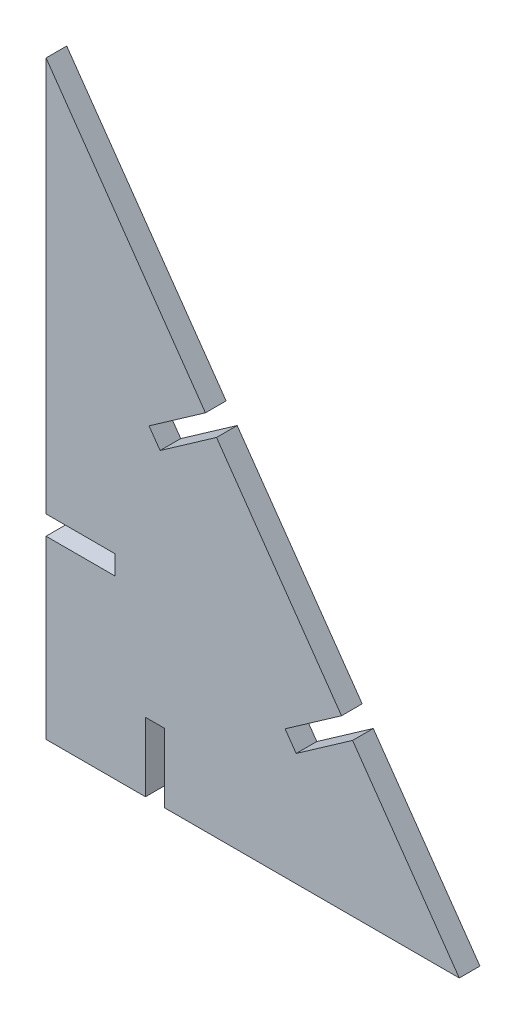
ISO-10303-21;
HEADER;
FILE_DESCRIPTION(('STEP AP214'),'2;1');
FILE_NAME('part.step','',(''),(''),'','','');
FILE_SCHEMA(('AUTOMOTIVE_DESIGN { 1 0 10303 214 1 1 1 1 }'));
ENDSEC;
DATA;
#1=APPLICATION_CONTEXT('core data for automotive mechanical design processes');
#2=APPLICATION_PROTOCOL_DEFINITION('international standard','automotive_design',2000,#1);
#3=PRODUCT_CONTEXT('',#1,'mechanical');
#4=PRODUCT('Part','Part','',(#3));
#5=PRODUCT_RELATED_PRODUCT_CATEGORY('part','',(#4));
#6=PRODUCT_DEFINITION_FORMATION('','',#4);
#7=PRODUCT_DEFINITION_CONTEXT('part definition',#1,'design');
#8=PRODUCT_DEFINITION('design','',#6,#7);
#9=PRODUCT_DEFINITION_SHAPE('','',#8);
#10=(LENGTH_UNIT() NAMED_UNIT(*) SI_UNIT(.MILLI.,.METRE.));
#11=(NAMED_UNIT(*) PLANE_ANGLE_UNIT() SI_UNIT($,.RADIAN.));
#12=(NAMED_UNIT(*) SI_UNIT($,.STERADIAN.) SOLID_ANGLE_UNIT());
#13=UNCERTAINTY_MEASURE_WITH_UNIT(LENGTH_MEASURE(1.E-05),#10,'distance_accuracy_value','');
#14=(GEOMETRIC_REPRESENTATION_CONTEXT(3) GLOBAL_UNCERTAINTY_ASSIGNED_CONTEXT((#13)) GLOBAL_UNIT_ASSIGNED_CONTEXT((#10,
#11,#12)) REPRESENTATION_CONTEXT('',''));
#15=CARTESIAN_POINT('',(0.,0.,0.));
#16=DIRECTION('',(0.,0.,1.));
#17=DIRECTION('',(1.,0.,0.));
#18=AXIS2_PLACEMENT_3D('',#15,#16,#17);
#19=CARTESIAN_POINT('',(0.,25.5534297505136,3.));
#20=DIRECTION('',(1.,0.,0.));
#21=DIRECTION('',(0.,0.,-1.));
#22=AXIS2_PLACEMENT_3D('',#19,#20,#21);
#23=PLANE('',#22);
#24=DIRECTION('',(0.,-1.,0.));
#25=VECTOR('',#24,1.);
#26=CARTESIAN_POINT('',(0.,25.5534297505136,0.));
#27=LINE('',#26,#25);
#28=CARTESIAN_POINT('',(0.,25.5534297505136,0.));
#29=VERTEX_POINT('',#28);
#30=CARTESIAN_POINT('',(0.,0.,0.));
#31=VERTEX_POINT('',#30);
#32=EDGE_CURVE('E194',#29,#31,#27,.T.);
#33=ORIENTED_EDGE('',*,*,#32,.T.);
#34=DIRECTION('',(0.,0.,-1.));
#35=VECTOR('',#34,1.);
#36=CARTESIAN_POINT('',(0.,0.,3.));
#37=LINE('',#36,#35);
#38=CARTESIAN_POINT('',(0.,0.,3.));
#39=VERTEX_POINT('',#38);
#40=EDGE_CURVE('E11',#39,#31,#37,.T.);
#41=ORIENTED_EDGE('',*,*,#40,.F.);
#42=DIRECTION('',(0.,-1.,0.));
#43=VECTOR('',#42,1.);
#44=CARTESIAN_POINT('',(0.,25.5534297505136,3.));
#45=LINE('',#44,#43);
#46=CARTESIAN_POINT('',(0.,25.5534297505136,3.));
#47=VERTEX_POINT('',#46);
#48=EDGE_CURVE('E230',#47,#39,#45,.T.);
#49=ORIENTED_EDGE('',*,*,#48,.F.);
#50=DIRECTION('',(0.,0.,-1.));
#51=VECTOR('',#50,1.);
#52=CARTESIAN_POINT('',(0.,25.5534297505136,3.));
#53=LINE('',#52,#51);
#54=EDGE_CURVE('E190',#47,#29,#53,.T.);
#55=ORIENTED_EDGE('',*,*,#54,.T.);
#56=EDGE_LOOP('',(#33,#41,#49,#55));
#57=FACE_BOUND('',#56,.T.);
#58=ADVANCED_FACE('F32',(#57),#23,.F.);
#59=CARTESIAN_POINT('',(0.,0.,3.));
#60=DIRECTION('',(0.,1.,0.));
#61=DIRECTION('',(0.,0.,1.));
#62=AXIS2_PLACEMENT_3D('',#59,#60,#61);
#63=PLANE('',#62);
#64=DIRECTION('',(1.,0.,0.));
#65=VECTOR('',#64,1.);
#66=CARTESIAN_POINT('',(0.,0.,0.));
#67=LINE('',#66,#65);
#68=CARTESIAN_POINT('',(14.4345484859993,0.,0.));
#69=VERTEX_POINT('',#68);
#70=EDGE_CURVE('E197',#31,#69,#67,.T.);
#71=ORIENTED_EDGE('',*,*,#70,.T.);
#72=DIRECTION('',(0.,0.,-1.));
#73=VECTOR('',#72,1.);
#74=CARTESIAN_POINT('',(14.4345484859993,0.,3.));
#75=LINE('',#74,#73);
#76=CARTESIAN_POINT('',(14.4345484859993,0.,3.));
#77=VERTEX_POINT('',#76);
#78=EDGE_CURVE('E40',#77,#69,#75,.T.);
#79=ORIENTED_EDGE('',*,*,#78,.F.);
#80=DIRECTION('',(1.,0.,0.));
#81=VECTOR('',#80,1.);
#82=CARTESIAN_POINT('',(0.,0.,3.));
#83=LINE('',#82,#81);
#84=EDGE_CURVE('E124',#39,#77,#83,.T.);
#85=ORIENTED_EDGE('',*,*,#84,.F.);
#86=ORIENTED_EDGE('',*,*,#40,.T.);
#87=EDGE_LOOP('',(#71,#79,#85,#86));
#88=FACE_BOUND('',#87,.T.);
#89=ADVANCED_FACE('F343',(#88),#63,.F.);
#90=CARTESIAN_POINT('',(14.4345484859993,0.,3.));
#91=DIRECTION('',(-1.,0.,0.));
#92=DIRECTION('',(0.,0.,1.));
#93=AXIS2_PLACEMENT_3D('',#90,#91,#92);
#94=PLANE('',#93);
#95=DIRECTION('',(0.,1.,0.));
#96=VECTOR('',#95,1.);
#97=CARTESIAN_POINT('',(14.4345484859993,0.,0.));
#98=LINE('',#97,#96);
#99=CARTESIAN_POINT('',(14.4345484859993,10.,0.));
#100=VERTEX_POINT('',#99);
#101=EDGE_CURVE('E199',#69,#100,#98,.T.);
#102=ORIENTED_EDGE('',*,*,#101,.T.);
#103=DIRECTION('',(0.,0.,-1.));
#104=VECTOR('',#103,1.);
#105=CARTESIAN_POINT('',(14.4345484859993,10.,3.));
#106=LINE('',#105,#104);
#107=CARTESIAN_POINT('',(14.4345484859993,10.,3.));
#108=VERTEX_POINT('',#107);
#109=EDGE_CURVE('E270',#108,#100,#106,.T.);
#110=ORIENTED_EDGE('',*,*,#109,.F.);
#111=DIRECTION('',(0.,1.,0.));
#112=VECTOR('',#111,1.);
#113=CARTESIAN_POINT('',(14.4345484859993,0.,3.));
#114=LINE('',#113,#112);
#115=EDGE_CURVE('E278',#77,#108,#114,.T.);
#116=ORIENTED_EDGE('',*,*,#115,.F.);
#117=ORIENTED_EDGE('',*,*,#78,.T.);
#118=EDGE_LOOP('',(#102,#110,#116,#117));
#119=FACE_BOUND('',#118,.T.);
#120=ADVANCED_FACE('F276',(#119),#94,.F.);
#121=CARTESIAN_POINT('',(14.4345484859993,10.,3.));
#122=DIRECTION('',(0.,1.,0.));
#123=DIRECTION('',(0.,0.,1.));
#124=AXIS2_PLACEMENT_3D('',#121,#122,#123);
#125=PLANE('',#124);
#126=DIRECTION('',(1.,0.,0.));
#127=VECTOR('',#126,1.);
#128=CARTESIAN_POINT('',(14.4345484859993,10.,0.));
#129=LINE('',#128,#127);
#130=CARTESIAN_POINT('',(17.2345484859993,10.,0.));
#131=VERTEX_POINT('',#130);
#132=EDGE_CURVE('E201',#100,#131,#129,.T.);
#133=ORIENTED_EDGE('',*,*,#132,.T.);
#134=DIRECTION('',(0.,0.,-1.));
#135=VECTOR('',#134,1.);
#136=CARTESIAN_POINT('',(17.2345484859993,10.,3.));
#137=LINE('',#136,#135);
#138=CARTESIAN_POINT('',(17.2345484859993,10.,3.));
#139=VERTEX_POINT('',#138);
#140=EDGE_CURVE('E267',#139,#131,#137,.T.);
#141=ORIENTED_EDGE('',*,*,#140,.F.);
#142=DIRECTION('',(1.,0.,0.));
#143=VECTOR('',#142,1.);
#144=CARTESIAN_POINT('',(14.4345484859993,10.,3.));
#145=LINE('',#144,#143);
#146=EDGE_CURVE('E296',#108,#139,#145,.T.);
#147=ORIENTED_EDGE('',*,*,#146,.F.);
#148=ORIENTED_EDGE('',*,*,#109,.T.);
#149=EDGE_LOOP('',(#133,#141,#147,#148));
#150=FACE_BOUND('',#149,.T.);
#151=ADVANCED_FACE('F287',(#150),#125,.F.);
#152=CARTESIAN_POINT('',(17.2345484859993,0.,3.));
#153=DIRECTION('',(1.,0.,0.));
#154=DIRECTION('',(0.,0.,-1.));
#155=AXIS2_PLACEMENT_3D('',#152,#153,#154);
#156=PLANE('',#155);
#157=DIRECTION('',(0.,-1.,0.));
#158=VECTOR('',#157,1.);
#159=CARTESIAN_POINT('',(17.2345484859993,0.,0.));
#160=LINE('',#159,#158);
#161=CARTESIAN_POINT('',(17.2345484859993,0.,0.));
#162=VERTEX_POINT('',#161);
#163=EDGE_CURVE('E203',#131,#162,#160,.T.);
#164=ORIENTED_EDGE('',*,*,#163,.T.);
#165=DIRECTION('',(0.,0.,-1.));
#166=VECTOR('',#165,1.);
#167=CARTESIAN_POINT('',(17.2345484859993,0.,3.));
#168=LINE('',#167,#166);
#169=CARTESIAN_POINT('',(17.2345484859993,0.,3.));
#170=VERTEX_POINT('',#169);
#171=EDGE_CURVE('E264',#170,#162,#168,.T.);
#172=ORIENTED_EDGE('',*,*,#171,.F.);
#173=DIRECTION('',(0.,-1.,0.));
#174=VECTOR('',#173,1.);
#175=CARTESIAN_POINT('',(17.2345484859993,0.,3.));
#176=LINE('',#175,#174);
#177=EDGE_CURVE('E293',#139,#170,#176,.T.);
#178=ORIENTED_EDGE('',*,*,#177,.F.);
#179=ORIENTED_EDGE('',*,*,#140,.T.);
#180=EDGE_LOOP('',(#164,#172,#178,#179));
#181=FACE_BOUND('',#180,.T.);
#182=ADVANCED_FACE('F291',(#181),#156,.F.);
#183=CARTESIAN_POINT('',(17.2345484859993,0.,3.));
#184=DIRECTION('',(0.,1.,0.));
#185=DIRECTION('',(0.,0.,1.));
#186=AXIS2_PLACEMENT_3D('',#183,#184,#185);
#187=PLANE('',#186);
#188=DIRECTION('',(1.,0.,0.));
#189=VECTOR('',#188,1.);
#190=CARTESIAN_POINT('',(17.2345484859993,0.,0.));
#191=LINE('',#190,#189);
#192=CARTESIAN_POINT('',(60.,0.,0.));
#193=VERTEX_POINT('',#192);
#194=EDGE_CURVE('E205',#162,#193,#191,.T.);
#195=ORIENTED_EDGE('',*,*,#194,.T.);
#196=DIRECTION('',(0.,0.,-1.));
#197=VECTOR('',#196,1.);
#198=CARTESIAN_POINT('',(60.,0.,3.));
#199=LINE('',#198,#197);
#200=CARTESIAN_POINT('',(60.,0.,3.));
#201=VERTEX_POINT('',#200);
#202=EDGE_CURVE('E261',#201,#193,#199,.T.);
#203=ORIENTED_EDGE('',*,*,#202,.F.);
#204=DIRECTION('',(1.,0.,0.));
#205=VECTOR('',#204,1.);
#206=CARTESIAN_POINT('',(17.2345484859993,0.,3.));
#207=LINE('',#206,#205);
#208=EDGE_CURVE('E295',#170,#201,#207,.T.);
#209=ORIENTED_EDGE('',*,*,#208,.F.);
#210=ORIENTED_EDGE('',*,*,#171,.T.);
#211=EDGE_LOOP('',(#195,#203,#209,#210));
#212=FACE_BOUND('',#211,.T.);
#213=ADVANCED_FACE('F356',(#212),#187,.F.);
#214=CARTESIAN_POINT('',(60.,0.,3.));
#215=DIRECTION('',(-0.819152044288989,-0.57357643635105,0.));
#216=DIRECTION('',(0.57357643635105,-0.819152044288989,0.));
#217=AXIS2_PLACEMENT_3D('',#214,#215,#216);
#218=PLANE('',#217);
#219=DIRECTION('',(-0.57357643635105,0.819152044288989,0.));
#220=VECTOR('',#219,1.);
#221=CARTESIAN_POINT('',(60.,0.,0.));
#222=LINE('',#221,#220);
#223=CARTESIAN_POINT('',(44.5057122198594,22.1281362090963,0.));
#224=VERTEX_POINT('',#223);
#225=EDGE_CURVE('E207',#193,#224,#222,.T.);
#226=ORIENTED_EDGE('',*,*,#225,.T.);
#227=DIRECTION('',(0.,0.,-1.));
#228=VECTOR('',#227,1.);
#229=CARTESIAN_POINT('',(44.5057122198594,22.1281362090963,3.));
#230=LINE('',#229,#228);
#231=CARTESIAN_POINT('',(44.5057122198594,22.1281362090963,3.));
#232=VERTEX_POINT('',#231);
#233=EDGE_CURVE('E258',#232,#224,#230,.T.);
#234=ORIENTED_EDGE('',*,*,#233,.F.);
#235=DIRECTION('',(-0.57357643635105,0.819152044288989,0.));
#236=VECTOR('',#235,1.);
#237=CARTESIAN_POINT('',(60.,0.,3.));
#238=LINE('',#237,#236);
#239=EDGE_CURVE('E298',#201,#232,#238,.T.);
#240=ORIENTED_EDGE('',*,*,#239,.F.);
#241=ORIENTED_EDGE('',*,*,#202,.T.);
#242=EDGE_LOOP('',(#226,#234,#240,#241));
#243=FACE_BOUND('',#242,.T.);
#244=ADVANCED_FACE('F359',(#243),#218,.F.);
#245=CARTESIAN_POINT('',(44.5057122198594,22.1281362090963,3.));
#246=DIRECTION('',(0.57357643635105,-0.819152044288989,0.));
#247=DIRECTION('',(0.819152044288989,0.57357643635105,0.));
#248=AXIS2_PLACEMENT_3D('',#245,#246,#247);
#249=PLANE('',#248);
#250=DIRECTION('',(-0.819152044288989,-0.57357643635105,0.));
#251=VECTOR('',#250,1.);
#252=CARTESIAN_POINT('',(44.5057122198594,22.1281362090963,0.));
#253=LINE('',#252,#251);
#254=CARTESIAN_POINT('',(36.3141917769695,16.3923718455858,0.));
#255=VERTEX_POINT('',#254);
#256=EDGE_CURVE('E209',#224,#255,#253,.T.);
#257=ORIENTED_EDGE('',*,*,#256,.T.);
#258=DIRECTION('',(0.,0.,-1.));
#259=VECTOR('',#258,1.);
#260=CARTESIAN_POINT('',(36.3141917769695,16.3923718455858,3.));
#261=LINE('',#260,#259);
#262=CARTESIAN_POINT('',(36.3141917769695,16.3923718455858,3.));
#263=VERTEX_POINT('',#262);
#264=EDGE_CURVE('E255',#263,#255,#261,.T.);
#265=ORIENTED_EDGE('',*,*,#264,.F.);
#266=DIRECTION('',(-0.819152044288989,-0.57357643635105,0.));
#267=VECTOR('',#266,1.);
#268=CARTESIAN_POINT('',(44.5057122198594,22.1281362090963,3.));
#269=LINE('',#268,#267);
#270=EDGE_CURVE('E304',#232,#263,#269,.T.);
#271=ORIENTED_EDGE('',*,*,#270,.F.);
#272=ORIENTED_EDGE('',*,*,#233,.T.);
#273=EDGE_LOOP('',(#257,#265,#271,#272));
#274=FACE_BOUND('',#273,.T.);
#275=ADVANCED_FACE('F363',(#274),#249,.F.);
#276=CARTESIAN_POINT('',(36.3141917769695,16.3923718455858,3.));
#277=DIRECTION('',(-0.819152044288989,-0.57357643635105,0.));
#278=DIRECTION('',(0.573576436351051,-0.819152044288989,0.));
#279=AXIS2_PLACEMENT_3D('',#276,#277,#278);
#280=PLANE('',#279);
#281=DIRECTION('',(-0.57357643635105,0.819152044288989,0.));
#282=VECTOR('',#281,1.);
#283=CARTESIAN_POINT('',(36.3141917769695,16.3923718455858,0.));
#284=LINE('',#283,#282);
#285=CARTESIAN_POINT('',(34.7081777551866,18.6859975695949,0.));
#286=VERTEX_POINT('',#285);
#287=EDGE_CURVE('E211',#255,#286,#284,.T.);
#288=ORIENTED_EDGE('',*,*,#287,.T.);
#289=DIRECTION('',(0.,0.,-1.));
#290=VECTOR('',#289,1.);
#291=CARTESIAN_POINT('',(34.7081777551866,18.6859975695949,3.));
#292=LINE('',#291,#290);
#293=CARTESIAN_POINT('',(34.7081777551866,18.6859975695949,3.));
#294=VERTEX_POINT('',#293);
#295=EDGE_CURVE('E252',#294,#286,#292,.T.);
#296=ORIENTED_EDGE('',*,*,#295,.F.);
#297=DIRECTION('',(-0.57357643635105,0.819152044288989,0.));
#298=VECTOR('',#297,1.);
#299=CARTESIAN_POINT('',(36.3141917769695,16.3923718455858,3.));
#300=LINE('',#299,#298);
#301=EDGE_CURVE('E306',#263,#294,#300,.T.);
#302=ORIENTED_EDGE('',*,*,#301,.F.);
#303=ORIENTED_EDGE('',*,*,#264,.T.);
#304=EDGE_LOOP('',(#288,#296,#302,#303));
#305=FACE_BOUND('',#304,.T.);
#306=ADVANCED_FACE('F367',(#305),#280,.F.);
#307=CARTESIAN_POINT('',(42.8996981980765,24.4217619331054,3.));
#308=DIRECTION('',(-0.57357643635105,0.819152044288989,0.));
#309=DIRECTION('',(-0.819152044288989,-0.57357643635105,0.));
#310=AXIS2_PLACEMENT_3D('',#307,#308,#309);
#311=PLANE('',#310);
#312=DIRECTION('',(0.819152044288989,0.57357643635105,0.));
#313=VECTOR('',#312,1.);
#314=CARTESIAN_POINT('',(42.8996981980765,24.4217619331054,0.));
#315=LINE('',#314,#313);
#316=CARTESIAN_POINT('',(42.8996981980765,24.4217619331054,0.));
#317=VERTEX_POINT('',#316);
#318=EDGE_CURVE('E213',#286,#317,#315,.T.);
#319=ORIENTED_EDGE('',*,*,#318,.T.);
#320=DIRECTION('',(0.,0.,-1.));
#321=VECTOR('',#320,1.);
#322=CARTESIAN_POINT('',(42.8996981980765,24.4217619331054,3.));
#323=LINE('',#322,#321);
#324=CARTESIAN_POINT('',(42.8996981980765,24.4217619331054,3.));
#325=VERTEX_POINT('',#324);
#326=EDGE_CURVE('E249',#325,#317,#323,.T.);
#327=ORIENTED_EDGE('',*,*,#326,.F.);
#328=DIRECTION('',(0.819152044288989,0.57357643635105,0.));
#329=VECTOR('',#328,1.);
#330=CARTESIAN_POINT('',(42.8996981980765,24.4217619331054,3.));
#331=LINE('',#330,#329);
#332=EDGE_CURVE('E308',#294,#325,#331,.T.);
#333=ORIENTED_EDGE('',*,*,#332,.F.);
#334=ORIENTED_EDGE('',*,*,#295,.T.);
#335=EDGE_LOOP('',(#319,#327,#333,#334));
#336=FACE_BOUND('',#335,.T.);
#337=ADVANCED_FACE('F371',(#336),#311,.F.);
#338=CARTESIAN_POINT('',(42.8996981980765,24.4217619331054,3.));
#339=DIRECTION('',(-0.819152044288989,-0.57357643635105,0.));
#340=DIRECTION('',(0.57357643635105,-0.819152044288989,0.));
#341=AXIS2_PLACEMENT_3D('',#338,#339,#340);
#342=PLANE('',#341);
#343=DIRECTION('',(-0.57357643635105,0.819152044288989,0.));
#344=VECTOR('',#343,1.);
#345=CARTESIAN_POINT('',(42.8996981980765,24.4217619331054,0.));
#346=LINE('',#345,#344);
#347=CARTESIAN_POINT('',(24.7495761790774,50.3428225166648,0.));
#348=VERTEX_POINT('',#347);
#349=EDGE_CURVE('E215',#317,#348,#346,.T.);
#350=ORIENTED_EDGE('',*,*,#349,.T.);
#351=DIRECTION('',(0.,0.,-1.));
#352=VECTOR('',#351,1.);
#353=CARTESIAN_POINT('',(24.7495761790774,50.3428225166648,3.));
#354=LINE('',#353,#352);
#355=CARTESIAN_POINT('',(24.7495761790774,50.3428225166648,3.));
#356=VERTEX_POINT('',#355);
#357=EDGE_CURVE('E246',#356,#348,#354,.T.);
#358=ORIENTED_EDGE('',*,*,#357,.F.);
#359=DIRECTION('',(-0.57357643635105,0.819152044288989,0.));
#360=VECTOR('',#359,1.);
#361=CARTESIAN_POINT('',(42.8996981980765,24.4217619331054,3.));
#362=LINE('',#361,#360);
#363=EDGE_CURVE('E310',#325,#356,#362,.T.);
#364=ORIENTED_EDGE('',*,*,#363,.F.);
#365=ORIENTED_EDGE('',*,*,#326,.T.);
#366=EDGE_LOOP('',(#350,#358,#364,#365));
#367=FACE_BOUND('',#366,.T.);
#368=ADVANCED_FACE('F375',(#367),#342,.F.);
#369=CARTESIAN_POINT('',(24.7495761790774,50.3428225166648,3.));
#370=DIRECTION('',(0.573576436351051,-0.819152044288988,0.));
#371=DIRECTION('',(0.819152044288988,0.573576436351051,0.));
#372=AXIS2_PLACEMENT_3D('',#369,#370,#371);
#373=PLANE('',#372);
#374=DIRECTION('',(-0.819152044288988,-0.573576436351051,0.));
#375=VECTOR('',#374,1.);
#376=CARTESIAN_POINT('',(24.7495761790774,50.3428225166648,0.));
#377=LINE('',#376,#375);
#378=CARTESIAN_POINT('',(16.5580557361875,44.6070581531543,0.));
#379=VERTEX_POINT('',#378);
#380=EDGE_CURVE('E217',#348,#379,#377,.T.);
#381=ORIENTED_EDGE('',*,*,#380,.T.);
#382=DIRECTION('',(0.,0.,-1.));
#383=VECTOR('',#382,1.);
#384=CARTESIAN_POINT('',(16.5580557361875,44.6070581531543,3.));
#385=LINE('',#384,#383);
#386=CARTESIAN_POINT('',(16.5580557361875,44.6070581531543,3.));
#387=VERTEX_POINT('',#386);
#388=EDGE_CURVE('E243',#387,#379,#385,.T.);
#389=ORIENTED_EDGE('',*,*,#388,.F.);
#390=DIRECTION('',(-0.819152044288988,-0.573576436351051,0.));
#391=VECTOR('',#390,1.);
#392=CARTESIAN_POINT('',(24.7495761790774,50.3428225166648,3.));
#393=LINE('',#392,#391);
#394=EDGE_CURVE('E312',#356,#387,#393,.T.);
#395=ORIENTED_EDGE('',*,*,#394,.F.);
#396=ORIENTED_EDGE('',*,*,#357,.T.);
#397=EDGE_LOOP('',(#381,#389,#395,#396));
#398=FACE_BOUND('',#397,.T.);
#399=ADVANCED_FACE('F379',(#398),#373,.F.);
#400=CARTESIAN_POINT('',(16.5580557361875,44.6070581531543,3.));
#401=DIRECTION('',(-0.819152044288999,-0.573576436351035,0.));
#402=DIRECTION('',(0.573576436351036,-0.819152044288999,0.));
#403=AXIS2_PLACEMENT_3D('',#400,#401,#402);
#404=PLANE('',#403);
#405=DIRECTION('',(-0.573576436351035,0.819152044288999,0.));
#406=VECTOR('',#405,1.);
#407=CARTESIAN_POINT('',(16.5580557361875,44.6070581531543,0.));
#408=LINE('',#407,#406);
#409=CARTESIAN_POINT('',(14.9520417144046,46.9006838771635,0.));
#410=VERTEX_POINT('',#409);
#411=EDGE_CURVE('E219',#379,#410,#408,.T.);
#412=ORIENTED_EDGE('',*,*,#411,.T.);
#413=DIRECTION('',(0.,0.,-1.));
#414=VECTOR('',#413,1.);
#415=CARTESIAN_POINT('',(14.9520417144046,46.9006838771635,3.));
#416=LINE('',#415,#414);
#417=CARTESIAN_POINT('',(14.9520417144046,46.9006838771635,3.));
#418=VERTEX_POINT('',#417);
#419=EDGE_CURVE('E240',#418,#410,#416,.T.);
#420=ORIENTED_EDGE('',*,*,#419,.F.);
#421=DIRECTION('',(-0.573576436351035,0.819152044288999,0.));
#422=VECTOR('',#421,1.);
#423=CARTESIAN_POINT('',(16.5580557361875,44.6070581531543,3.));
#424=LINE('',#423,#422);
#425=EDGE_CURVE('E314',#387,#418,#424,.T.);
#426=ORIENTED_EDGE('',*,*,#425,.F.);
#427=ORIENTED_EDGE('',*,*,#388,.T.);
#428=EDGE_LOOP('',(#412,#420,#426,#427));
#429=FACE_BOUND('',#428,.T.);
#430=ADVANCED_FACE('F383',(#429),#404,.F.);
#431=CARTESIAN_POINT('',(23.1435621572945,52.636448240674,3.));
#432=DIRECTION('',(-0.573576436351052,0.819152044288988,0.));
#433=DIRECTION('',(-0.819152044288988,-0.573576436351052,0.));
#434=AXIS2_PLACEMENT_3D('',#431,#432,#433);
#435=PLANE('',#434);
#436=DIRECTION('',(0.819152044288988,0.573576436351052,0.));
#437=VECTOR('',#436,1.);
#438=CARTESIAN_POINT('',(23.1435621572945,52.636448240674,0.));
#439=LINE('',#438,#437);
#440=CARTESIAN_POINT('',(23.1435621572945,52.636448240674,0.));
#441=VERTEX_POINT('',#440);
#442=EDGE_CURVE('E221',#410,#441,#439,.T.);
#443=ORIENTED_EDGE('',*,*,#442,.T.);
#444=DIRECTION('',(0.,0.,-1.));
#445=VECTOR('',#444,1.);
#446=CARTESIAN_POINT('',(23.1435621572945,52.636448240674,3.));
#447=LINE('',#446,#445);
#448=CARTESIAN_POINT('',(23.1435621572945,52.636448240674,3.));
#449=VERTEX_POINT('',#448);
#450=EDGE_CURVE('E237',#449,#441,#447,.T.);
#451=ORIENTED_EDGE('',*,*,#450,.F.);
#452=DIRECTION('',(0.819152044288988,0.573576436351052,0.));
#453=VECTOR('',#452,1.);
#454=CARTESIAN_POINT('',(23.1435621572945,52.636448240674,3.));
#455=LINE('',#454,#453);
#456=EDGE_CURVE('E316',#418,#449,#455,.T.);
#457=ORIENTED_EDGE('',*,*,#456,.F.);
#458=ORIENTED_EDGE('',*,*,#419,.T.);
#459=EDGE_LOOP('',(#443,#451,#457,#458));
#460=FACE_BOUND('',#459,.T.);
#461=ADVANCED_FACE('F387',(#460),#435,.F.);
#462=CARTESIAN_POINT('',(23.1435621572945,52.636448240674,3.));
#463=DIRECTION('',(-0.819152044288989,-0.57357643635105,0.));
#464=DIRECTION('',(0.57357643635105,-0.819152044288989,0.));
#465=AXIS2_PLACEMENT_3D('',#462,#463,#464);
#466=PLANE('',#465);
#467=DIRECTION('',(-0.57357643635105,0.819152044288989,0.));
#468=VECTOR('',#467,1.);
#469=CARTESIAN_POINT('',(23.1435621572945,52.636448240674,0.));
#470=LINE('',#469,#468);
#471=CARTESIAN_POINT('',(0.,85.688880404526,0.));
#472=VERTEX_POINT('',#471);
#473=EDGE_CURVE('E223',#441,#472,#470,.T.);
#474=ORIENTED_EDGE('',*,*,#473,.T.);
#475=DIRECTION('',(0.,0.,-1.));
#476=VECTOR('',#475,1.);
#477=CARTESIAN_POINT('',(0.,85.688880404526,3.));
#478=LINE('',#477,#476);
#479=CARTESIAN_POINT('',(0.,85.688880404526,3.));
#480=VERTEX_POINT('',#479);
#481=EDGE_CURVE('E234',#480,#472,#478,.T.);
#482=ORIENTED_EDGE('',*,*,#481,.F.);
#483=DIRECTION('',(-0.57357643635105,0.819152044288989,0.));
#484=VECTOR('',#483,1.);
#485=CARTESIAN_POINT('',(23.1435621572945,52.636448240674,3.));
#486=LINE('',#485,#484);
#487=EDGE_CURVE('E318',#449,#480,#486,.T.);
#488=ORIENTED_EDGE('',*,*,#487,.F.);
#489=ORIENTED_EDGE('',*,*,#450,.T.);
#490=EDGE_LOOP('',(#474,#482,#488,#489));
#491=FACE_BOUND('',#490,.T.);
#492=ADVANCED_FACE('F324',(#491),#466,.F.);
#493=CARTESIAN_POINT('',(0.,85.688880404526,3.));
#494=DIRECTION('',(1.,0.,0.));
#495=DIRECTION('',(0.,1.,0.));
#496=AXIS2_PLACEMENT_3D('',#493,#494,#495);
#497=PLANE('',#496);
#498=DIRECTION('',(0.,-1.,0.));
#499=VECTOR('',#498,1.);
#500=CARTESIAN_POINT('',(0.,85.688880404526,0.));
#501=LINE('',#500,#499);
#502=CARTESIAN_POINT('',(0.,28.3534297505136,0.));
#503=VERTEX_POINT('',#502);
#504=EDGE_CURVE('E225',#472,#503,#501,.T.);
#505=ORIENTED_EDGE('',*,*,#504,.T.);
#506=DIRECTION('',(0.,0.,-1.));
#507=VECTOR('',#506,1.);
#508=CARTESIAN_POINT('',(0.,28.3534297505136,3.));
#509=LINE('',#508,#507);
#510=CARTESIAN_POINT('',(0.,28.3534297505136,3.));
#511=VERTEX_POINT('',#510);
#512=EDGE_CURVE('E185',#511,#503,#509,.T.);
#513=ORIENTED_EDGE('',*,*,#512,.F.);
#514=DIRECTION('',(0.,-1.,0.));
#515=VECTOR('',#514,1.);
#516=CARTESIAN_POINT('',(0.,85.688880404526,3.));
#517=LINE('',#516,#515);
#518=EDGE_CURVE('E176',#480,#511,#517,.T.);
#519=ORIENTED_EDGE('',*,*,#518,.F.);
#520=ORIENTED_EDGE('',*,*,#481,.T.);
#521=EDGE_LOOP('',(#505,#513,#519,#520));
#522=FACE_BOUND('',#521,.T.);
#523=ADVANCED_FACE('F328',(#522),#497,.F.);
#524=CARTESIAN_POINT('',(0.,28.3534297505136,3.));
#525=DIRECTION('',(0.,1.,0.));
#526=DIRECTION('',(0.,0.,1.));
#527=AXIS2_PLACEMENT_3D('',#524,#525,#526);
#528=PLANE('',#527);
#529=DIRECTION('',(1.,0.,0.));
#530=VECTOR('',#529,1.);
#531=CARTESIAN_POINT('',(0.,28.3534297505136,0.));
#532=LINE('',#531,#530);
#533=CARTESIAN_POINT('',(10.,28.3534297505136,0.));
#534=VERTEX_POINT('',#533);
#535=EDGE_CURVE('E184',#503,#534,#532,.T.);
#536=ORIENTED_EDGE('',*,*,#535,.T.);
#537=DIRECTION('',(0.,0.,-1.));
#538=VECTOR('',#537,1.);
#539=CARTESIAN_POINT('',(10.,28.3534297505136,3.));
#540=LINE('',#539,#538);
#541=CARTESIAN_POINT('',(10.,28.3534297505136,3.));
#542=VERTEX_POINT('',#541);
#543=EDGE_CURVE('E181',#542,#534,#540,.T.);
#544=ORIENTED_EDGE('',*,*,#543,.F.);
#545=DIRECTION('',(1.,0.,0.));
#546=VECTOR('',#545,1.);
#547=CARTESIAN_POINT('',(0.,28.3534297505136,3.));
#548=LINE('',#547,#546);
#549=EDGE_CURVE('E170',#511,#542,#548,.T.);
#550=ORIENTED_EDGE('',*,*,#549,.F.);
#551=ORIENTED_EDGE('',*,*,#512,.T.);
#552=EDGE_LOOP('',(#536,#544,#550,#551));
#553=FACE_BOUND('',#552,.T.);
#554=ADVANCED_FACE('F182',(#553),#528,.F.);
#555=CARTESIAN_POINT('',(10.,25.5534297505136,3.));
#556=DIRECTION('',(1.,0.,0.));
#557=DIRECTION('',(0.,1.,0.));
#558=AXIS2_PLACEMENT_3D('',#555,#556,#557);
#559=PLANE('',#558);
#560=DIRECTION('',(0.,-1.,0.));
#561=VECTOR('',#560,1.);
#562=CARTESIAN_POINT('',(10.,25.5534297505136,0.));
#563=LINE('',#562,#561);
#564=CARTESIAN_POINT('',(10.,25.5534297505136,0.));
#565=VERTEX_POINT('',#564);
#566=EDGE_CURVE('E110',#534,#565,#563,.T.);
#567=ORIENTED_EDGE('',*,*,#566,.T.);
#568=DIRECTION('',(0.,0.,-1.));
#569=VECTOR('',#568,1.);
#570=CARTESIAN_POINT('',(10.,25.5534297505136,3.));
#571=LINE('',#570,#569);
#572=CARTESIAN_POINT('',(10.,25.5534297505136,3.));
#573=VERTEX_POINT('',#572);
#574=EDGE_CURVE('E186',#573,#565,#571,.T.);
#575=ORIENTED_EDGE('',*,*,#574,.F.);
#576=DIRECTION('',(0.,-1.,0.));
#577=VECTOR('',#576,1.);
#578=CARTESIAN_POINT('',(10.,25.5534297505136,3.));
#579=LINE('',#578,#577);
#580=EDGE_CURVE('E174',#542,#573,#579,.T.);
#581=ORIENTED_EDGE('',*,*,#580,.F.);
#582=ORIENTED_EDGE('',*,*,#543,.T.);
#583=EDGE_LOOP('',(#567,#575,#581,#582));
#584=FACE_BOUND('',#583,.T.);
#585=ADVANCED_FACE('F188',(#584),#559,.F.);
#586=CARTESIAN_POINT('',(0.,25.5534297505136,3.));
#587=DIRECTION('',(0.,-1.,0.));
#588=DIRECTION('',(0.,0.,-1.));
#589=AXIS2_PLACEMENT_3D('',#586,#587,#588);
#590=PLANE('',#589);
#591=DIRECTION('',(-1.,0.,0.));
#592=VECTOR('',#591,1.);
#593=CARTESIAN_POINT('',(0.,25.5534297505136,0.));
#594=LINE('',#593,#592);
#595=EDGE_CURVE('E116',#565,#29,#594,.T.);
#596=ORIENTED_EDGE('',*,*,#595,.T.);
#597=ORIENTED_EDGE('',*,*,#54,.F.);
#598=DIRECTION('',(-1.,0.,0.));
#599=VECTOR('',#598,1.);
#600=CARTESIAN_POINT('',(0.,25.5534297505136,3.));
#601=LINE('',#600,#599);
#602=EDGE_CURVE('E48',#573,#47,#601,.T.);
#603=ORIENTED_EDGE('',*,*,#602,.F.);
#604=ORIENTED_EDGE('',*,*,#574,.T.);
#605=EDGE_LOOP('',(#596,#597,#603,#604));
#606=FACE_BOUND('',#605,.T.);
#607=ADVANCED_FACE('F332',(#606),#590,.F.);
#608=CARTESIAN_POINT('',(0.,0.,3.));
#609=DIRECTION('',(0.,0.,1.));
#610=DIRECTION('',(1.,0.,0.));
#611=AXIS2_PLACEMENT_3D('',#608,#609,#610);
#612=PLANE('',#611);
#613=ORIENTED_EDGE('',*,*,#48,.T.);
#614=ORIENTED_EDGE('',*,*,#84,.T.);
#615=ORIENTED_EDGE('',*,*,#115,.T.);
#616=ORIENTED_EDGE('',*,*,#146,.T.);
#617=ORIENTED_EDGE('',*,*,#177,.T.);
#618=ORIENTED_EDGE('',*,*,#208,.T.);
#619=ORIENTED_EDGE('',*,*,#239,.T.);
#620=ORIENTED_EDGE('',*,*,#270,.T.);
#621=ORIENTED_EDGE('',*,*,#301,.T.);
#622=ORIENTED_EDGE('',*,*,#332,.T.);
#623=ORIENTED_EDGE('',*,*,#363,.T.);
#624=ORIENTED_EDGE('',*,*,#394,.T.);
#625=ORIENTED_EDGE('',*,*,#425,.T.);
#626=ORIENTED_EDGE('',*,*,#456,.T.);
#627=ORIENTED_EDGE('',*,*,#487,.T.);
#628=ORIENTED_EDGE('',*,*,#518,.T.);
#629=ORIENTED_EDGE('',*,*,#549,.T.);
#630=ORIENTED_EDGE('',*,*,#580,.T.);
#631=ORIENTED_EDGE('',*,*,#602,.T.);
#632=EDGE_LOOP('',(#613,#614,#615,#616,#617,#618,#619,#620,#621,#622,#623,#624,#625,#626,#627,
#628,#629,#630,#631));
#633=FACE_BOUND('',#632,.T.);
#634=ADVANCED_FACE('F172',(#633),#612,.T.);
#635=CARTESIAN_POINT('',(0.,0.,0.));
#636=DIRECTION('',(0.,0.,1.));
#637=DIRECTION('',(1.,0.,0.));
#638=AXIS2_PLACEMENT_3D('',#635,#636,#637);
#639=PLANE('',#638);
#640=ORIENTED_EDGE('',*,*,#32,.F.);
#641=ORIENTED_EDGE('',*,*,#595,.F.);
#642=ORIENTED_EDGE('',*,*,#566,.F.);
#643=ORIENTED_EDGE('',*,*,#535,.F.);
#644=ORIENTED_EDGE('',*,*,#504,.F.);
#645=ORIENTED_EDGE('',*,*,#473,.F.);
#646=ORIENTED_EDGE('',*,*,#442,.F.);
#647=ORIENTED_EDGE('',*,*,#411,.F.);
#648=ORIENTED_EDGE('',*,*,#380,.F.);
#649=ORIENTED_EDGE('',*,*,#349,.F.);
#650=ORIENTED_EDGE('',*,*,#318,.F.);
#651=ORIENTED_EDGE('',*,*,#287,.F.);
#652=ORIENTED_EDGE('',*,*,#256,.F.);
#653=ORIENTED_EDGE('',*,*,#225,.F.);
#654=ORIENTED_EDGE('',*,*,#194,.F.);
#655=ORIENTED_EDGE('',*,*,#163,.F.);
#656=ORIENTED_EDGE('',*,*,#132,.F.);
#657=ORIENTED_EDGE('',*,*,#101,.F.);
#658=ORIENTED_EDGE('',*,*,#70,.F.);
#659=EDGE_LOOP('',(#640,#641,#642,#643,#644,#645,#646,#647,#648,#649,#650,#651,#652,#653,#654,
#655,#656,#657,#658));
#660=FACE_BOUND('',#659,.T.);
#661=ADVANCED_FACE('F282',(#660),#639,.F.);
#662=CLOSED_SHELL('',(#58,#89,#120,#151,#182,#213,#244,#275,#306,#337,#368,#399,#430,#461,#492,
#523,#554,#585,#607,#634,#661));
#663=MANIFOLD_SOLID_BREP('B2',#662);
#664=ADVANCED_BREP_SHAPE_REPRESENTATION('',(#18,#663),#14);
#665=SHAPE_DEFINITION_REPRESENTATION(#9,#664);
ENDSEC;
END-ISO-10303-21;
